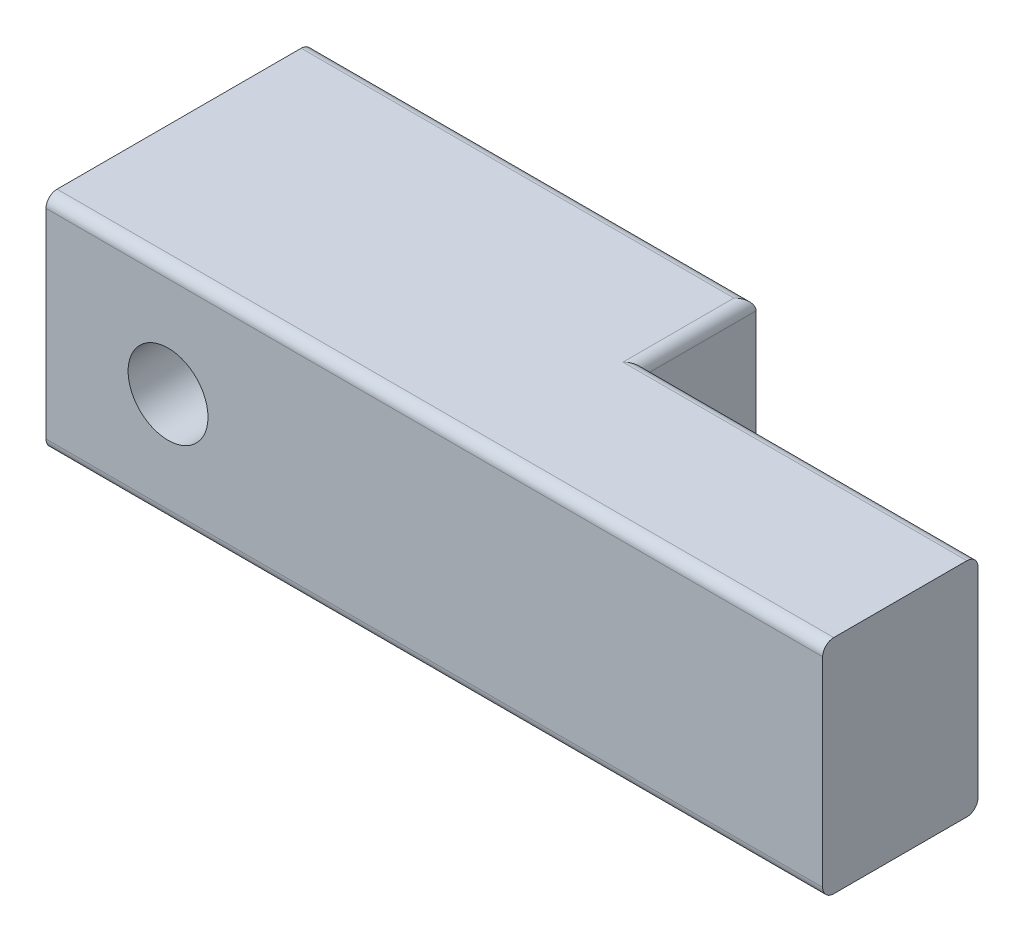
ISO-10303-21;
HEADER;
FILE_DESCRIPTION(('STEP AP214'),'2;1');
FILE_NAME('part.step','',(''),(''),'','','');
FILE_SCHEMA(('AUTOMOTIVE_DESIGN { 1 0 10303 214 1 1 1 1 }'));
ENDSEC;
DATA;
#1=APPLICATION_CONTEXT('core data for automotive mechanical design processes');
#2=APPLICATION_PROTOCOL_DEFINITION('international standard','automotive_design',2000,#1);
#3=PRODUCT_CONTEXT('',#1,'mechanical');
#4=PRODUCT('Part','Part','',(#3));
#5=PRODUCT_RELATED_PRODUCT_CATEGORY('part','',(#4));
#6=PRODUCT_DEFINITION_FORMATION('','',#4);
#7=PRODUCT_DEFINITION_CONTEXT('part definition',#1,'design');
#8=PRODUCT_DEFINITION('design','',#6,#7);
#9=PRODUCT_DEFINITION_SHAPE('','',#8);
#10=(LENGTH_UNIT() NAMED_UNIT(*) SI_UNIT(.MILLI.,.METRE.));
#11=(NAMED_UNIT(*) PLANE_ANGLE_UNIT() SI_UNIT($,.RADIAN.));
#12=(NAMED_UNIT(*) SI_UNIT($,.STERADIAN.) SOLID_ANGLE_UNIT());
#13=UNCERTAINTY_MEASURE_WITH_UNIT(LENGTH_MEASURE(1.E-05),#10,'distance_accuracy_value','');
#14=(GEOMETRIC_REPRESENTATION_CONTEXT(3) GLOBAL_UNCERTAINTY_ASSIGNED_CONTEXT((#13)) GLOBAL_UNIT_ASSIGNED_CONTEXT((#10,
#11,#12)) REPRESENTATION_CONTEXT('',''));
#15=CARTESIAN_POINT('',(0.,0.,0.));
#16=DIRECTION('',(0.,0.,1.));
#17=DIRECTION('',(1.,0.,0.));
#18=AXIS2_PLACEMENT_3D('',#15,#16,#17);
#19=CARTESIAN_POINT('',(17.5,-5.,7.));
#20=DIRECTION('',(-1.,0.,0.));
#21=DIRECTION('',(0.,0.,1.));
#22=AXIS2_PLACEMENT_3D('',#19,#20,#21);
#23=PLANE('',#22);
#24=DIRECTION('',(0.,1.,0.));
#25=VECTOR('',#24,1.);
#26=CARTESIAN_POINT('',(17.5,-5.,0.));
#27=LINE('',#26,#25);
#28=CARTESIAN_POINT('',(17.5,-4.5,0.));
#29=VERTEX_POINT('',#28);
#30=CARTESIAN_POINT('',(17.5,4.5,0.));
#31=VERTEX_POINT('',#30);
#32=EDGE_CURVE('E186',#29,#31,#27,.T.);
#33=ORIENTED_EDGE('',*,*,#32,.T.);
#34=CARTESIAN_POINT('',(17.5,4.5,0.5));
#35=DIRECTION('',(-1.,0.,0.));
#36=DIRECTION('',(0.,0.,1.));
#37=AXIS2_PLACEMENT_3D('',#34,#35,#36);
#38=CIRCLE('',#37,0.5);
#39=CARTESIAN_POINT('',(17.5,5.,0.5));
#40=VERTEX_POINT('',#39);
#41=EDGE_CURVE('E229',#31,#40,#38,.F.);
#42=ORIENTED_EDGE('',*,*,#41,.T.);
#43=DIRECTION('',(0.,0.,-1.));
#44=VECTOR('',#43,1.);
#45=CARTESIAN_POINT('',(17.5,5.,7.));
#46=LINE('',#45,#44);
#47=CARTESIAN_POINT('',(17.5,5.,6.5));
#48=VERTEX_POINT('',#47);
#49=EDGE_CURVE('E140',#48,#40,#46,.T.);
#50=ORIENTED_EDGE('',*,*,#49,.F.);
#51=CARTESIAN_POINT('',(17.5,4.5,6.5));
#52=DIRECTION('',(-1.,0.,0.));
#53=DIRECTION('',(0.,0.,1.));
#54=AXIS2_PLACEMENT_3D('',#51,#52,#53);
#55=CIRCLE('',#54,0.5);
#56=CARTESIAN_POINT('',(17.5,4.5,7.));
#57=VERTEX_POINT('',#56);
#58=EDGE_CURVE('E223',#48,#57,#55,.F.);
#59=ORIENTED_EDGE('',*,*,#58,.T.);
#60=DIRECTION('',(0.,1.,0.));
#61=VECTOR('',#60,1.);
#62=CARTESIAN_POINT('',(17.5,-5.,7.));
#63=LINE('',#62,#61);
#64=CARTESIAN_POINT('',(17.5,-4.5,7.));
#65=VERTEX_POINT('',#64);
#66=EDGE_CURVE('E189',#65,#57,#63,.T.);
#67=ORIENTED_EDGE('',*,*,#66,.F.);
#68=CARTESIAN_POINT('',(17.5,-4.5,6.5));
#69=DIRECTION('',(-1.,0.,0.));
#70=DIRECTION('',(0.,0.,1.));
#71=AXIS2_PLACEMENT_3D('',#68,#69,#70);
#72=CIRCLE('',#71,0.5);
#73=CARTESIAN_POINT('',(17.5,-5.,6.5));
#74=VERTEX_POINT('',#73);
#75=EDGE_CURVE('E225',#65,#74,#72,.F.);
#76=ORIENTED_EDGE('',*,*,#75,.T.);
#77=DIRECTION('',(0.,0.,-1.));
#78=VECTOR('',#77,1.);
#79=CARTESIAN_POINT('',(17.5,-5.,7.));
#80=LINE('',#79,#78);
#81=CARTESIAN_POINT('',(17.5,-5.,0.5));
#82=VERTEX_POINT('',#81);
#83=EDGE_CURVE('E137',#74,#82,#80,.T.);
#84=ORIENTED_EDGE('',*,*,#83,.T.);
#85=CARTESIAN_POINT('',(17.5,-4.5,0.5));
#86=DIRECTION('',(-1.,0.,0.));
#87=DIRECTION('',(0.,0.,1.));
#88=AXIS2_PLACEMENT_3D('',#85,#86,#87);
#89=CIRCLE('',#88,0.5);
#90=EDGE_CURVE('E227',#82,#29,#89,.F.);
#91=ORIENTED_EDGE('',*,*,#90,.T.);
#92=EDGE_LOOP('',(#33,#42,#50,#59,#67,#76,#84,#91));
#93=FACE_BOUND('',#92,.T.);
#94=ADVANCED_FACE('F36',(#93),#23,.F.);
#95=CARTESIAN_POINT('',(-17.5,5.,7.));
#96=DIRECTION('',(0.,-1.,0.));
#97=DIRECTION('',(0.,0.,-1.));
#98=AXIS2_PLACEMENT_3D('',#95,#96,#97);
#99=PLANE('',#98);
#100=ORIENTED_EDGE('',*,*,#49,.T.);
#101=DIRECTION('',(-1.,0.,0.));
#102=VECTOR('',#101,1.);
#103=CARTESIAN_POINT('',(2.5,5.,0.5));
#104=LINE('',#103,#102);
#105=CARTESIAN_POINT('',(2.,5.,0.5));
#106=VERTEX_POINT('',#105);
#107=EDGE_CURVE('E217',#40,#106,#104,.T.);
#108=ORIENTED_EDGE('',*,*,#107,.T.);
#109=DIRECTION('',(0.,0.,1.));
#110=VECTOR('',#109,1.);
#111=CARTESIAN_POINT('',(1.99999999999999,5.,7.));
#112=LINE('',#111,#110);
#113=CARTESIAN_POINT('',(2.,5.,-4.5));
#114=VERTEX_POINT('',#113);
#115=EDGE_CURVE('E215',#106,#114,#112,.F.);
#116=ORIENTED_EDGE('',*,*,#115,.T.);
#117=DIRECTION('',(1.,0.,0.));
#118=VECTOR('',#117,1.);
#119=CARTESIAN_POINT('',(-17.5,5.,-4.5));
#120=LINE('',#119,#118);
#121=CARTESIAN_POINT('',(-17.5,5.,-4.5));
#122=VERTEX_POINT('',#121);
#123=EDGE_CURVE('E213',#114,#122,#120,.F.);
#124=ORIENTED_EDGE('',*,*,#123,.T.);
#125=DIRECTION('',(0.,0.,-1.));
#126=VECTOR('',#125,1.);
#127=CARTESIAN_POINT('',(-17.5,5.,7.));
#128=LINE('',#127,#126);
#129=CARTESIAN_POINT('',(-17.5,5.,6.5));
#130=VERTEX_POINT('',#129);
#131=EDGE_CURVE('E146',#130,#122,#128,.T.);
#132=ORIENTED_EDGE('',*,*,#131,.F.);
#133=DIRECTION('',(-1.,0.,0.));
#134=VECTOR('',#133,1.);
#135=CARTESIAN_POINT('',(-17.5,5.,6.5));
#136=LINE('',#135,#134);
#137=EDGE_CURVE('E211',#130,#48,#136,.F.);
#138=ORIENTED_EDGE('',*,*,#137,.T.);
#139=EDGE_LOOP('',(#100,#108,#116,#124,#132,#138));
#140=FACE_BOUND('',#139,.T.);
#141=ADVANCED_FACE('F269',(#140),#99,.F.);
#142=CARTESIAN_POINT('',(-17.5,-5.,7.));
#143=DIRECTION('',(1.,0.,0.));
#144=DIRECTION('',(0.,0.,-1.));
#145=AXIS2_PLACEMENT_3D('',#142,#143,#144);
#146=PLANE('',#145);
#147=DIRECTION('',(0.,1.,0.));
#148=VECTOR('',#147,1.);
#149=CARTESIAN_POINT('',(-17.5,5.,-5.));
#150=LINE('',#149,#148);
#151=CARTESIAN_POINT('',(-17.5,-4.5,-5.));
#152=VERTEX_POINT('',#151);
#153=CARTESIAN_POINT('',(-17.5,4.5,-5.));
#154=VERTEX_POINT('',#153);
#155=EDGE_CURVE('E180',#152,#154,#150,.T.);
#156=ORIENTED_EDGE('',*,*,#155,.F.);
#157=CARTESIAN_POINT('',(-17.5,-4.5,-4.5));
#158=DIRECTION('',(1.,0.,0.));
#159=DIRECTION('',(0.,0.,-1.));
#160=AXIS2_PLACEMENT_3D('',#157,#158,#159);
#161=CIRCLE('',#160,0.5);
#162=CARTESIAN_POINT('',(-17.5,-5.,-4.5));
#163=VERTEX_POINT('',#162);
#164=EDGE_CURVE('E145',#152,#163,#161,.F.);
#165=ORIENTED_EDGE('',*,*,#164,.T.);
#166=DIRECTION('',(0.,0.,-1.));
#167=VECTOR('',#166,1.);
#168=CARTESIAN_POINT('',(-17.5,-5.,7.));
#169=LINE('',#168,#167);
#170=CARTESIAN_POINT('',(-17.5,-5.,6.5));
#171=VERTEX_POINT('',#170);
#172=EDGE_CURVE('E134',#171,#163,#169,.T.);
#173=ORIENTED_EDGE('',*,*,#172,.F.);
#174=CARTESIAN_POINT('',(-17.5,-4.5,6.5));
#175=DIRECTION('',(1.,0.,0.));
#176=DIRECTION('',(0.,0.,-1.));
#177=AXIS2_PLACEMENT_3D('',#174,#175,#176);
#178=CIRCLE('',#177,0.5);
#179=CARTESIAN_POINT('',(-17.5,-4.5,7.));
#180=VERTEX_POINT('',#179);
#181=EDGE_CURVE('E53',#171,#180,#178,.F.);
#182=ORIENTED_EDGE('',*,*,#181,.T.);
#183=DIRECTION('',(0.,-1.,0.));
#184=VECTOR('',#183,1.);
#185=CARTESIAN_POINT('',(-17.5,-5.,7.));
#186=LINE('',#185,#184);
#187=CARTESIAN_POINT('',(-17.5,4.5,7.));
#188=VERTEX_POINT('',#187);
#189=EDGE_CURVE('E192',#188,#180,#186,.T.);
#190=ORIENTED_EDGE('',*,*,#189,.F.);
#191=CARTESIAN_POINT('',(-17.5,4.5,6.5));
#192=DIRECTION('',(1.,0.,0.));
#193=DIRECTION('',(0.,0.,-1.));
#194=AXIS2_PLACEMENT_3D('',#191,#192,#193);
#195=CIRCLE('',#194,0.5);
#196=EDGE_CURVE('E61',#188,#130,#195,.F.);
#197=ORIENTED_EDGE('',*,*,#196,.T.);
#198=ORIENTED_EDGE('',*,*,#131,.T.);
#199=CARTESIAN_POINT('',(-17.5,4.5,-4.5));
#200=DIRECTION('',(1.,0.,0.));
#201=DIRECTION('',(0.,0.,-1.));
#202=AXIS2_PLACEMENT_3D('',#199,#200,#201);
#203=CIRCLE('',#202,0.5);
#204=EDGE_CURVE('E150',#122,#154,#203,.F.);
#205=ORIENTED_EDGE('',*,*,#204,.T.);
#206=EDGE_LOOP('',(#156,#165,#173,#182,#190,#197,#198,#205));
#207=FACE_BOUND('',#206,.T.);
#208=ADVANCED_FACE('F143',(#207),#146,.F.);
#209=CARTESIAN_POINT('',(-17.5,-5.,7.));
#210=DIRECTION('',(0.,1.,0.));
#211=DIRECTION('',(0.,0.,1.));
#212=AXIS2_PLACEMENT_3D('',#209,#210,#211);
#213=PLANE('',#212);
#214=DIRECTION('',(0.,0.,1.));
#215=VECTOR('',#214,1.);
#216=CARTESIAN_POINT('',(1.99999999999999,-5.,7.));
#217=LINE('',#216,#215);
#218=CARTESIAN_POINT('',(1.99999999999999,-5.,-4.5));
#219=VERTEX_POINT('',#218);
#220=CARTESIAN_POINT('',(1.99999999999999,-5.,0.5));
#221=VERTEX_POINT('',#220);
#222=EDGE_CURVE('E202',#219,#221,#217,.T.);
#223=ORIENTED_EDGE('',*,*,#222,.T.);
#224=DIRECTION('',(1.,0.,0.));
#225=VECTOR('',#224,1.);
#226=CARTESIAN_POINT('',(17.5,-5.,0.5));
#227=LINE('',#226,#225);
#228=EDGE_CURVE('E204',#221,#82,#227,.T.);
#229=ORIENTED_EDGE('',*,*,#228,.T.);
#230=ORIENTED_EDGE('',*,*,#83,.F.);
#231=DIRECTION('',(1.,0.,0.));
#232=VECTOR('',#231,1.);
#233=CARTESIAN_POINT('',(-17.5,-5.,6.5));
#234=LINE('',#233,#232);
#235=EDGE_CURVE('E131',#74,#171,#234,.F.);
#236=ORIENTED_EDGE('',*,*,#235,.T.);
#237=ORIENTED_EDGE('',*,*,#172,.T.);
#238=DIRECTION('',(-1.,0.,0.));
#239=VECTOR('',#238,1.);
#240=CARTESIAN_POINT('',(-17.5,-5.,-4.5));
#241=LINE('',#240,#239);
#242=EDGE_CURVE('E139',#163,#219,#241,.F.);
#243=ORIENTED_EDGE('',*,*,#242,.T.);
#244=EDGE_LOOP('',(#223,#229,#230,#236,#237,#243));
#245=FACE_BOUND('',#244,.T.);
#246=ADVANCED_FACE('F133',(#245),#213,.F.);
#247=CARTESIAN_POINT('',(0.,0.,7.));
#248=DIRECTION('',(0.,0.,-1.));
#249=DIRECTION('',(-1.,0.,0.));
#250=AXIS2_PLACEMENT_3D('',#247,#248,#249);
#251=PLANE('',#250);
#252=CARTESIAN_POINT('',(-12.,0.,7.));
#253=DIRECTION('',(0.,0.,1.));
#254=DIRECTION('',(1.,0.,0.));
#255=AXIS2_PLACEMENT_3D('',#252,#253,#254);
#256=CIRCLE('',#255,1.8);
#257=CARTESIAN_POINT('',(-10.2,0.,7.));
#258=VERTEX_POINT('',#257);
#259=EDGE_CURVE('E173',#258,#258,#256,.T.);
#260=ORIENTED_EDGE('',*,*,#259,.F.);
#261=EDGE_LOOP('',(#260));
#262=FACE_BOUND('',#261,.T.);
#263=ORIENTED_EDGE('',*,*,#189,.T.);
#264=DIRECTION('',(1.,0.,0.));
#265=VECTOR('',#264,1.);
#266=CARTESIAN_POINT('',(0.,-4.5,7.));
#267=LINE('',#266,#265);
#268=EDGE_CURVE('E11',#180,#65,#267,.T.);
#269=ORIENTED_EDGE('',*,*,#268,.T.);
#270=ORIENTED_EDGE('',*,*,#66,.T.);
#271=DIRECTION('',(-1.,0.,0.));
#272=VECTOR('',#271,1.);
#273=CARTESIAN_POINT('',(0.,4.5,7.));
#274=LINE('',#273,#272);
#275=EDGE_CURVE('E45',#57,#188,#274,.T.);
#276=ORIENTED_EDGE('',*,*,#275,.T.);
#277=EDGE_LOOP('',(#263,#269,#270,#276));
#278=FACE_BOUND('',#277,.T.);
#279=ADVANCED_FACE('F271',(#262,#278),#251,.F.);
#280=CARTESIAN_POINT('',(0.,0.,0.));
#281=DIRECTION('',(0.,0.,-1.));
#282=DIRECTION('',(-1.,0.,0.));
#283=AXIS2_PLACEMENT_3D('',#280,#281,#282);
#284=PLANE('',#283);
#285=DIRECTION('',(0.,-1.,0.));
#286=VECTOR('',#285,1.);
#287=CARTESIAN_POINT('',(2.5,5.,0.));
#288=LINE('',#287,#286);
#289=CARTESIAN_POINT('',(2.5,4.5,0.));
#290=VERTEX_POINT('',#289);
#291=CARTESIAN_POINT('',(2.5,-4.5,0.));
#292=VERTEX_POINT('',#291);
#293=EDGE_CURVE('E163',#290,#292,#288,.T.);
#294=ORIENTED_EDGE('',*,*,#293,.F.);
#295=DIRECTION('',(-1.,0.,0.));
#296=VECTOR('',#295,1.);
#297=CARTESIAN_POINT('',(17.5,4.5,0.));
#298=LINE('',#297,#296);
#299=EDGE_CURVE('E221',#290,#31,#298,.F.);
#300=ORIENTED_EDGE('',*,*,#299,.T.);
#301=ORIENTED_EDGE('',*,*,#32,.F.);
#302=DIRECTION('',(1.,0.,0.));
#303=VECTOR('',#302,1.);
#304=CARTESIAN_POINT('',(2.5,-4.5,0.));
#305=LINE('',#304,#303);
#306=EDGE_CURVE('E219',#29,#292,#305,.F.);
#307=ORIENTED_EDGE('',*,*,#306,.T.);
#308=EDGE_LOOP('',(#294,#300,#301,#307));
#309=FACE_BOUND('',#308,.T.);
#310=ADVANCED_FACE('F256',(#309),#284,.T.);
#311=CARTESIAN_POINT('',(2.5,5.,-5.));
#312=DIRECTION('',(-1.,0.,0.));
#313=DIRECTION('',(0.,0.,1.));
#314=AXIS2_PLACEMENT_3D('',#311,#312,#313);
#315=PLANE('',#314);
#316=ORIENTED_EDGE('',*,*,#293,.T.);
#317=DIRECTION('',(0.,0.,1.));
#318=VECTOR('',#317,1.);
#319=CARTESIAN_POINT('',(2.5,-4.5,-5.));
#320=LINE('',#319,#318);
#321=CARTESIAN_POINT('',(2.5,-4.5,-5.));
#322=VERTEX_POINT('',#321);
#323=EDGE_CURVE('E209',#292,#322,#320,.F.);
#324=ORIENTED_EDGE('',*,*,#323,.T.);
#325=DIRECTION('',(0.,-1.,0.));
#326=VECTOR('',#325,1.);
#327=CARTESIAN_POINT('',(2.5,5.,-5.));
#328=LINE('',#327,#326);
#329=CARTESIAN_POINT('',(2.5,4.5,-5.));
#330=VERTEX_POINT('',#329);
#331=EDGE_CURVE('E183',#330,#322,#328,.T.);
#332=ORIENTED_EDGE('',*,*,#331,.F.);
#333=DIRECTION('',(0.,0.,1.));
#334=VECTOR('',#333,1.);
#335=CARTESIAN_POINT('',(2.5,4.5,-5.));
#336=LINE('',#335,#334);
#337=EDGE_CURVE('E206',#330,#290,#336,.T.);
#338=ORIENTED_EDGE('',*,*,#337,.T.);
#339=EDGE_LOOP('',(#316,#324,#332,#338));
#340=FACE_BOUND('',#339,.T.);
#341=ADVANCED_FACE('F261',(#340),#315,.F.);
#342=CARTESIAN_POINT('',(0.,0.,-5.));
#343=DIRECTION('',(0.,0.,1.));
#344=DIRECTION('',(1.,0.,0.));
#345=AXIS2_PLACEMENT_3D('',#342,#343,#344);
#346=PLANE('',#345);
#347=CARTESIAN_POINT('',(-12.,0.,-5.));
#348=DIRECTION('',(0.,0.,1.));
#349=DIRECTION('',(1.,0.,0.));
#350=AXIS2_PLACEMENT_3D('',#347,#348,#349);
#351=CIRCLE('',#350,1.8);
#352=CARTESIAN_POINT('',(-10.2,0.,-5.));
#353=VERTEX_POINT('',#352);
#354=EDGE_CURVE('E165',#353,#353,#351,.T.);
#355=ORIENTED_EDGE('',*,*,#354,.T.);
#356=EDGE_LOOP('',(#355));
#357=FACE_BOUND('',#356,.T.);
#358=ORIENTED_EDGE('',*,*,#331,.T.);
#359=DIRECTION('',(-1.,0.,0.));
#360=VECTOR('',#359,1.);
#361=CARTESIAN_POINT('',(0.,-4.5,-5.));
#362=LINE('',#361,#360);
#363=EDGE_CURVE('E153',#322,#152,#362,.T.);
#364=ORIENTED_EDGE('',*,*,#363,.T.);
#365=ORIENTED_EDGE('',*,*,#155,.T.);
#366=DIRECTION('',(1.,0.,0.));
#367=VECTOR('',#366,1.);
#368=CARTESIAN_POINT('',(0.,4.5,-5.));
#369=LINE('',#368,#367);
#370=EDGE_CURVE('E231',#154,#330,#369,.T.);
#371=ORIENTED_EDGE('',*,*,#370,.T.);
#372=EDGE_LOOP('',(#358,#364,#365,#371));
#373=FACE_BOUND('',#372,.T.);
#374=ADVANCED_FACE('F234',(#357,#373),#346,.F.);
#375=CARTESIAN_POINT('',(0.,-4.5,-4.5));
#376=DIRECTION('',(-1.,0.,0.));
#377=DIRECTION('',(0.,0.,1.));
#378=AXIS2_PLACEMENT_3D('',#375,#376,#377);
#379=CYLINDRICAL_SURFACE('',#378,0.5);
#380=ORIENTED_EDGE('',*,*,#164,.F.);
#381=ORIENTED_EDGE('',*,*,#363,.F.);
#382=CARTESIAN_POINT('',(1.99999999999999,-4.5,-4.5));
#383=DIRECTION('',(-0.707106781186547,0.,-0.707106781186547));
#384=DIRECTION('',(-0.707106781186547,0.,0.707106781186547));
#385=AXIS2_PLACEMENT_3D('',#382,#383,#384);
#386=ELLIPSE('',#385,0.707106781186547,0.5);
#387=EDGE_CURVE('E161',#219,#322,#386,.F.);
#388=ORIENTED_EDGE('',*,*,#387,.F.);
#389=ORIENTED_EDGE('',*,*,#242,.F.);
#390=EDGE_LOOP('',(#380,#381,#388,#389));
#391=FACE_BOUND('',#390,.T.);
#392=ADVANCED_FACE('F240',(#391),#379,.T.);
#393=CARTESIAN_POINT('',(-17.5,-4.5,0.5));
#394=DIRECTION('',(-1.,0.,0.));
#395=DIRECTION('',(0.,0.,1.));
#396=AXIS2_PLACEMENT_3D('',#393,#394,#395);
#397=CYLINDRICAL_SURFACE('',#396,0.5);
#398=ORIENTED_EDGE('',*,*,#90,.F.);
#399=ORIENTED_EDGE('',*,*,#228,.F.);
#400=CARTESIAN_POINT('',(1.99999999999999,-4.5,0.5));
#401=DIRECTION('',(0.707106781186547,0.,0.707106781186547));
#402=DIRECTION('',(-0.707106781186547,0.,0.707106781186547));
#403=AXIS2_PLACEMENT_3D('',#400,#401,#402);
#404=ELLIPSE('',#403,0.707106781186547,0.5);
#405=EDGE_CURVE('E159',#292,#221,#404,.F.);
#406=ORIENTED_EDGE('',*,*,#405,.F.);
#407=ORIENTED_EDGE('',*,*,#306,.F.);
#408=EDGE_LOOP('',(#398,#399,#406,#407));
#409=FACE_BOUND('',#408,.T.);
#410=ADVANCED_FACE('F250',(#409),#397,.T.);
#411=CARTESIAN_POINT('',(1.99999999999999,-4.5,7.));
#412=DIRECTION('',(0.,0.,1.));
#413=DIRECTION('',(1.,0.,0.));
#414=AXIS2_PLACEMENT_3D('',#411,#412,#413);
#415=CYLINDRICAL_SURFACE('',#414,0.5);
#416=ORIENTED_EDGE('',*,*,#387,.T.);
#417=ORIENTED_EDGE('',*,*,#323,.F.);
#418=ORIENTED_EDGE('',*,*,#405,.T.);
#419=ORIENTED_EDGE('',*,*,#222,.F.);
#420=EDGE_LOOP('',(#416,#417,#418,#419));
#421=FACE_BOUND('',#420,.T.);
#422=ADVANCED_FACE('F244',(#421),#415,.T.);
#423=CARTESIAN_POINT('',(0.,4.5,-4.5));
#424=DIRECTION('',(1.,0.,0.));
#425=DIRECTION('',(0.,0.,-1.));
#426=AXIS2_PLACEMENT_3D('',#423,#424,#425);
#427=CYLINDRICAL_SURFACE('',#426,0.5);
#428=ORIENTED_EDGE('',*,*,#204,.F.);
#429=ORIENTED_EDGE('',*,*,#123,.F.);
#430=CARTESIAN_POINT('',(2.,4.5,-4.5));
#431=DIRECTION('',(0.707106781186547,0.,0.707106781186547));
#432=DIRECTION('',(0.707106781186547,0.,-0.707106781186547));
#433=AXIS2_PLACEMENT_3D('',#430,#431,#432);
#434=ELLIPSE('',#433,0.707106781186547,0.5);
#435=EDGE_CURVE('E40',#330,#114,#434,.T.);
#436=ORIENTED_EDGE('',*,*,#435,.F.);
#437=ORIENTED_EDGE('',*,*,#370,.F.);
#438=EDGE_LOOP('',(#428,#429,#436,#437));
#439=FACE_BOUND('',#438,.T.);
#440=ADVANCED_FACE('F266',(#439),#427,.T.);
#441=CARTESIAN_POINT('',(-17.5,4.5,0.5));
#442=DIRECTION('',(1.,0.,0.));
#443=DIRECTION('',(0.,0.,-1.));
#444=AXIS2_PLACEMENT_3D('',#441,#442,#443);
#445=CYLINDRICAL_SURFACE('',#444,0.5);
#446=ORIENTED_EDGE('',*,*,#41,.F.);
#447=ORIENTED_EDGE('',*,*,#299,.F.);
#448=CARTESIAN_POINT('',(1.99999999999999,4.5,0.5));
#449=DIRECTION('',(0.707106781186547,0.,0.707106781186547));
#450=DIRECTION('',(-0.707106781186547,0.,0.707106781186547));
#451=AXIS2_PLACEMENT_3D('',#448,#449,#450);
#452=ELLIPSE('',#451,0.707106781186547,0.5);
#453=EDGE_CURVE('E164',#106,#290,#452,.F.);
#454=ORIENTED_EDGE('',*,*,#453,.F.);
#455=ORIENTED_EDGE('',*,*,#107,.F.);
#456=EDGE_LOOP('',(#446,#447,#454,#455));
#457=FACE_BOUND('',#456,.T.);
#458=ADVANCED_FACE('F258',(#457),#445,.T.);
#459=CARTESIAN_POINT('',(2.,4.5,-5.));
#460=DIRECTION('',(0.,0.,1.));
#461=DIRECTION('',(1.,0.,0.));
#462=AXIS2_PLACEMENT_3D('',#459,#460,#461);
#463=CYLINDRICAL_SURFACE('',#462,0.5);
#464=ORIENTED_EDGE('',*,*,#435,.T.);
#465=ORIENTED_EDGE('',*,*,#115,.F.);
#466=ORIENTED_EDGE('',*,*,#453,.T.);
#467=ORIENTED_EDGE('',*,*,#337,.F.);
#468=EDGE_LOOP('',(#464,#465,#466,#467));
#469=FACE_BOUND('',#468,.T.);
#470=ADVANCED_FACE('F263',(#469),#463,.T.);
#471=CARTESIAN_POINT('',(0.,-4.5,6.5));
#472=DIRECTION('',(1.,0.,0.));
#473=DIRECTION('',(0.,0.,-1.));
#474=AXIS2_PLACEMENT_3D('',#471,#472,#473);
#475=CYLINDRICAL_SURFACE('',#474,0.5);
#476=ORIENTED_EDGE('',*,*,#181,.F.);
#477=ORIENTED_EDGE('',*,*,#235,.F.);
#478=ORIENTED_EDGE('',*,*,#75,.F.);
#479=ORIENTED_EDGE('',*,*,#268,.F.);
#480=EDGE_LOOP('',(#476,#477,#478,#479));
#481=FACE_BOUND('',#480,.T.);
#482=ADVANCED_FACE('F149',(#481),#475,.T.);
#483=CARTESIAN_POINT('',(0.,4.5,6.5));
#484=DIRECTION('',(-1.,0.,0.));
#485=DIRECTION('',(0.,0.,1.));
#486=AXIS2_PLACEMENT_3D('',#483,#484,#485);
#487=CYLINDRICAL_SURFACE('',#486,0.5);
#488=ORIENTED_EDGE('',*,*,#58,.F.);
#489=ORIENTED_EDGE('',*,*,#137,.F.);
#490=ORIENTED_EDGE('',*,*,#196,.F.);
#491=ORIENTED_EDGE('',*,*,#275,.F.);
#492=EDGE_LOOP('',(#488,#489,#490,#491));
#493=FACE_BOUND('',#492,.T.);
#494=ADVANCED_FACE('F38',(#493),#487,.T.);
#495=CARTESIAN_POINT('',(-12.,0.,7.));
#496=DIRECTION('',(0.,0.,1.));
#497=DIRECTION('',(1.,0.,0.));
#498=AXIS2_PLACEMENT_3D('',#495,#496,#497);
#499=CYLINDRICAL_SURFACE('',#498,1.8);
#500=ORIENTED_EDGE('',*,*,#354,.F.);
#501=EDGE_LOOP('',(#500));
#502=FACE_BOUND('',#501,.T.);
#503=ORIENTED_EDGE('',*,*,#259,.T.);
#504=EDGE_LOOP('',(#503));
#505=FACE_BOUND('',#504,.T.);
#506=ADVANCED_FACE('F276',(#502,#505),#499,.F.);
#507=CLOSED_SHELL('',(#94,#141,#208,#246,#279,#310,#341,#374,#392,#410,#422,#440,#458,#470,#482,
#494,#506));
#508=MANIFOLD_SOLID_BREP('B2',#507);
#509=ADVANCED_BREP_SHAPE_REPRESENTATION('',(#18,#508),#14);
#510=SHAPE_DEFINITION_REPRESENTATION(#9,#509);
ENDSEC;
END-ISO-10303-21;
